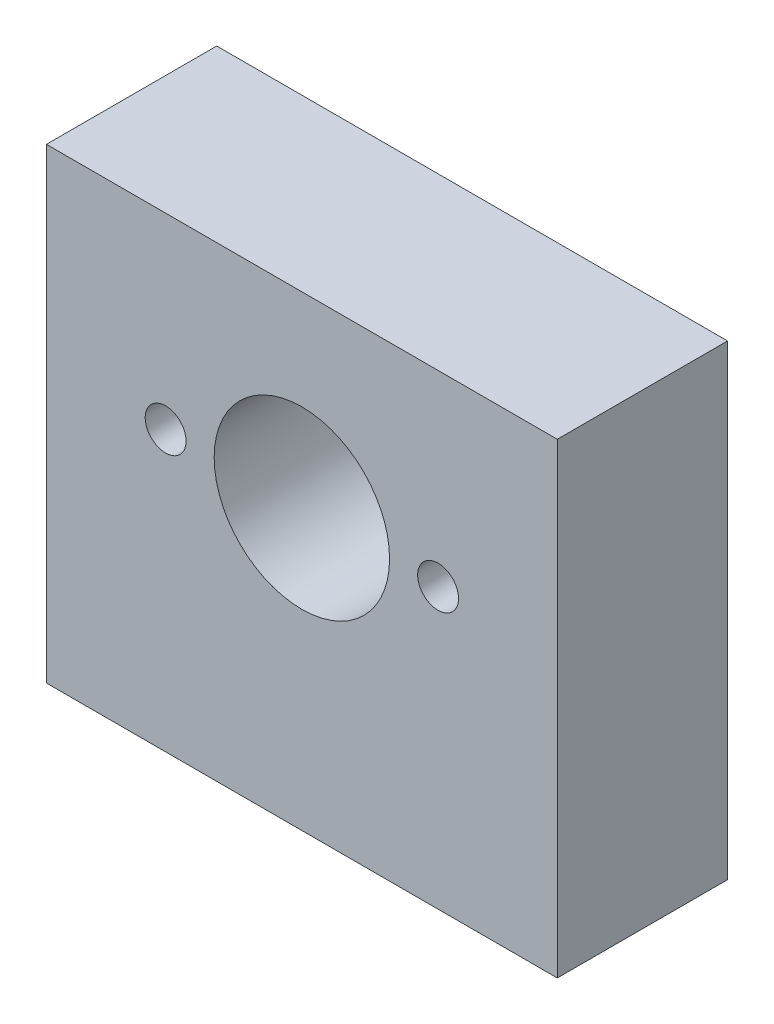
ISO-10303-21;
HEADER;
FILE_DESCRIPTION(('STEP AP214'),'2;1');
FILE_NAME('part.step','',(''),(''),'','','');
FILE_SCHEMA(('AUTOMOTIVE_DESIGN { 1 0 10303 214 1 1 1 1 }'));
ENDSEC;
DATA;
#1=APPLICATION_CONTEXT('core data for automotive mechanical design processes');
#2=APPLICATION_PROTOCOL_DEFINITION('international standard','automotive_design',2000,#1);
#3=PRODUCT_CONTEXT('',#1,'mechanical');
#4=PRODUCT('Part','Part','',(#3));
#5=PRODUCT_RELATED_PRODUCT_CATEGORY('part','',(#4));
#6=PRODUCT_DEFINITION_FORMATION('','',#4);
#7=PRODUCT_DEFINITION_CONTEXT('part definition',#1,'design');
#8=PRODUCT_DEFINITION('design','',#6,#7);
#9=PRODUCT_DEFINITION_SHAPE('','',#8);
#10=(LENGTH_UNIT() NAMED_UNIT(*) SI_UNIT(.MILLI.,.METRE.));
#11=(NAMED_UNIT(*) PLANE_ANGLE_UNIT() SI_UNIT($,.RADIAN.));
#12=(NAMED_UNIT(*) SI_UNIT($,.STERADIAN.) SOLID_ANGLE_UNIT());
#13=UNCERTAINTY_MEASURE_WITH_UNIT(LENGTH_MEASURE(1.E-05),#10,'distance_accuracy_value','');
#14=(GEOMETRIC_REPRESENTATION_CONTEXT(3) GLOBAL_UNCERTAINTY_ASSIGNED_CONTEXT((#13)) GLOBAL_UNIT_ASSIGNED_CONTEXT((#10,
#11,#12)) REPRESENTATION_CONTEXT('',''));
#15=CARTESIAN_POINT('',(0.,0.,0.));
#16=DIRECTION('',(0.,0.,1.));
#17=DIRECTION('',(1.,0.,0.));
#18=AXIS2_PLACEMENT_3D('',#15,#16,#17);
#19=CARTESIAN_POINT('',(0.,0.,10.));
#20=DIRECTION('',(0.,0.,1.));
#21=DIRECTION('',(1.,0.,0.));
#22=AXIS2_PLACEMENT_3D('',#19,#20,#21);
#23=PLANE('',#22);
#24=CARTESIAN_POINT('',(-8.,0.,10.));
#25=DIRECTION('',(0.,0.,1.));
#26=DIRECTION('',(1.,0.,0.));
#27=AXIS2_PLACEMENT_3D('',#24,#25,#26);
#28=CIRCLE('',#27,1.2);
#29=CARTESIAN_POINT('',(-6.8,0.,10.));
#30=VERTEX_POINT('',#29);
#31=EDGE_CURVE('E162',#30,#30,#28,.T.);
#32=ORIENTED_EDGE('',*,*,#31,.F.);
#33=EDGE_LOOP('',(#32));
#34=FACE_BOUND('',#33,.T.);
#35=CARTESIAN_POINT('',(8.,0.,10.));
#36=DIRECTION('',(0.,0.,1.));
#37=DIRECTION('',(-1.,0.,0.));
#38=AXIS2_PLACEMENT_3D('',#35,#36,#37);
#39=CIRCLE('',#38,1.2);
#40=CARTESIAN_POINT('',(6.8,0.,10.));
#41=VERTEX_POINT('',#40);
#42=EDGE_CURVE('E154',#41,#41,#39,.T.);
#43=ORIENTED_EDGE('',*,*,#42,.F.);
#44=EDGE_LOOP('',(#43));
#45=FACE_BOUND('',#44,.T.);
#46=DIRECTION('',(0.,-1.,0.));
#47=VECTOR('',#46,1.);
#48=CARTESIAN_POINT('',(-15.,-16.4,10.));
#49=LINE('',#48,#47);
#50=CARTESIAN_POINT('',(-15.,11.,10.));
#51=VERTEX_POINT('',#50);
#52=CARTESIAN_POINT('',(-15.,-16.4,10.));
#53=VERTEX_POINT('',#52);
#54=EDGE_CURVE('E92',#51,#53,#49,.T.);
#55=ORIENTED_EDGE('',*,*,#54,.T.);
#56=DIRECTION('',(1.,0.,0.));
#57=VECTOR('',#56,1.);
#58=CARTESIAN_POINT('',(15.,-16.4,10.));
#59=LINE('',#58,#57);
#60=CARTESIAN_POINT('',(15.,-16.4,10.));
#61=VERTEX_POINT('',#60);
#62=EDGE_CURVE('E87',#53,#61,#59,.T.);
#63=ORIENTED_EDGE('',*,*,#62,.T.);
#64=DIRECTION('',(0.,1.,0.));
#65=VECTOR('',#64,1.);
#66=CARTESIAN_POINT('',(15.,-16.4,10.));
#67=LINE('',#66,#65);
#68=CARTESIAN_POINT('',(15.,11.,10.));
#69=VERTEX_POINT('',#68);
#70=EDGE_CURVE('E90',#61,#69,#67,.T.);
#71=ORIENTED_EDGE('',*,*,#70,.T.);
#72=DIRECTION('',(-1.,0.,0.));
#73=VECTOR('',#72,1.);
#74=CARTESIAN_POINT('',(15.,11.,10.));
#75=LINE('',#74,#73);
#76=EDGE_CURVE('E57',#69,#51,#75,.T.);
#77=ORIENTED_EDGE('',*,*,#76,.T.);
#78=EDGE_LOOP('',(#55,#63,#71,#77));
#79=FACE_BOUND('',#78,.T.);
#80=CARTESIAN_POINT('',(0.,0.,10.));
#81=DIRECTION('',(0.,0.,1.));
#82=DIRECTION('',(1.,0.,0.));
#83=AXIS2_PLACEMENT_3D('',#80,#81,#82);
#84=CIRCLE('',#83,5.15);
#85=CARTESIAN_POINT('',(5.15,0.,10.));
#86=VERTEX_POINT('',#85);
#87=EDGE_CURVE('E112',#86,#86,#84,.T.);
#88=ORIENTED_EDGE('',*,*,#87,.F.);
#89=EDGE_LOOP('',(#88));
#90=FACE_BOUND('',#89,.T.);
#91=ADVANCED_FACE('F39',(#34,#45,#79,#90),#23,.T.);
#92=CARTESIAN_POINT('',(0.,0.,0.));
#93=DIRECTION('',(0.,0.,1.));
#94=DIRECTION('',(1.,0.,0.));
#95=AXIS2_PLACEMENT_3D('',#92,#93,#94);
#96=PLANE('',#95);
#97=CARTESIAN_POINT('',(-8.,0.,0.));
#98=DIRECTION('',(0.,0.,1.));
#99=DIRECTION('',(1.,0.,0.));
#100=AXIS2_PLACEMENT_3D('',#97,#98,#99);
#101=CIRCLE('',#100,1.2);
#102=CARTESIAN_POINT('',(-6.8,0.,0.));
#103=VERTEX_POINT('',#102);
#104=EDGE_CURVE('E143',#103,#103,#101,.T.);
#105=ORIENTED_EDGE('',*,*,#104,.T.);
#106=EDGE_LOOP('',(#105));
#107=FACE_BOUND('',#106,.T.);
#108=CARTESIAN_POINT('',(8.,0.,0.));
#109=DIRECTION('',(0.,0.,1.));
#110=DIRECTION('',(-1.,0.,0.));
#111=AXIS2_PLACEMENT_3D('',#108,#109,#110);
#112=CIRCLE('',#111,1.2);
#113=CARTESIAN_POINT('',(6.8,0.,0.));
#114=VERTEX_POINT('',#113);
#115=EDGE_CURVE('E158',#114,#114,#112,.T.);
#116=ORIENTED_EDGE('',*,*,#115,.T.);
#117=EDGE_LOOP('',(#116));
#118=FACE_BOUND('',#117,.T.);
#119=DIRECTION('',(0.,-1.,0.));
#120=VECTOR('',#119,1.);
#121=CARTESIAN_POINT('',(-15.,-16.4,0.));
#122=LINE('',#121,#120);
#123=CARTESIAN_POINT('',(-15.,11.,0.));
#124=VERTEX_POINT('',#123);
#125=CARTESIAN_POINT('',(-15.,-16.4,0.));
#126=VERTEX_POINT('',#125);
#127=EDGE_CURVE('E108',#124,#126,#122,.T.);
#128=ORIENTED_EDGE('',*,*,#127,.F.);
#129=DIRECTION('',(-1.,0.,0.));
#130=VECTOR('',#129,1.);
#131=CARTESIAN_POINT('',(15.,11.,0.));
#132=LINE('',#131,#130);
#133=CARTESIAN_POINT('',(15.,11.,0.));
#134=VERTEX_POINT('',#133);
#135=EDGE_CURVE('E80',#134,#124,#132,.T.);
#136=ORIENTED_EDGE('',*,*,#135,.F.);
#137=DIRECTION('',(0.,1.,0.));
#138=VECTOR('',#137,1.);
#139=CARTESIAN_POINT('',(15.,-16.4,0.));
#140=LINE('',#139,#138);
#141=CARTESIAN_POINT('',(15.,-16.4,0.));
#142=VERTEX_POINT('',#141);
#143=EDGE_CURVE('E74',#142,#134,#140,.T.);
#144=ORIENTED_EDGE('',*,*,#143,.F.);
#145=DIRECTION('',(1.,0.,0.));
#146=VECTOR('',#145,1.);
#147=CARTESIAN_POINT('',(15.,-16.4,0.));
#148=LINE('',#147,#146);
#149=EDGE_CURVE('E97',#126,#142,#148,.T.);
#150=ORIENTED_EDGE('',*,*,#149,.F.);
#151=EDGE_LOOP('',(#128,#136,#144,#150));
#152=FACE_BOUND('',#151,.T.);
#153=CARTESIAN_POINT('',(0.,0.,0.));
#154=DIRECTION('',(0.,0.,1.));
#155=DIRECTION('',(1.,0.,0.));
#156=AXIS2_PLACEMENT_3D('',#153,#154,#155);
#157=CIRCLE('',#156,5.15);
#158=CARTESIAN_POINT('',(5.15,0.,0.));
#159=VERTEX_POINT('',#158);
#160=EDGE_CURVE('E130',#159,#159,#157,.T.);
#161=ORIENTED_EDGE('',*,*,#160,.T.);
#162=EDGE_LOOP('',(#161));
#163=FACE_BOUND('',#162,.T.);
#164=ADVANCED_FACE('F125',(#107,#118,#152,#163),#96,.F.);
#165=CARTESIAN_POINT('',(-15.,-16.4,10.));
#166=DIRECTION('',(1.,0.,0.));
#167=DIRECTION('',(0.,1.,0.));
#168=AXIS2_PLACEMENT_3D('',#165,#166,#167);
#169=PLANE('',#168);
#170=ORIENTED_EDGE('',*,*,#127,.T.);
#171=DIRECTION('',(0.,0.,-1.));
#172=VECTOR('',#171,1.);
#173=CARTESIAN_POINT('',(-15.,-16.4,10.));
#174=LINE('',#173,#172);
#175=EDGE_CURVE('E11',#53,#126,#174,.T.);
#176=ORIENTED_EDGE('',*,*,#175,.F.);
#177=ORIENTED_EDGE('',*,*,#54,.F.);
#178=DIRECTION('',(0.,0.,-1.));
#179=VECTOR('',#178,1.);
#180=CARTESIAN_POINT('',(-15.,11.,10.));
#181=LINE('',#180,#179);
#182=EDGE_CURVE('E104',#51,#124,#181,.T.);
#183=ORIENTED_EDGE('',*,*,#182,.T.);
#184=EDGE_LOOP('',(#170,#176,#177,#183));
#185=FACE_BOUND('',#184,.T.);
#186=ADVANCED_FACE('F41',(#185),#169,.F.);
#187=CARTESIAN_POINT('',(15.,-16.4,10.));
#188=DIRECTION('',(0.,1.,0.));
#189=DIRECTION('',(0.,0.,1.));
#190=AXIS2_PLACEMENT_3D('',#187,#188,#189);
#191=PLANE('',#190);
#192=CARTESIAN_POINT('',(-11.,-16.4,5.));
#193=DIRECTION('',(0.,-1.,0.));
#194=DIRECTION('',(0.,0.,-1.));
#195=AXIS2_PLACEMENT_3D('',#192,#193,#194);
#196=CIRCLE('',#195,2.);
#197=CARTESIAN_POINT('',(-11.,-16.4,3.));
#198=VERTEX_POINT('',#197);
#199=EDGE_CURVE('E147',#198,#198,#196,.T.);
#200=ORIENTED_EDGE('',*,*,#199,.F.);
#201=EDGE_LOOP('',(#200));
#202=FACE_BOUND('',#201,.T.);
#203=CARTESIAN_POINT('',(11.,-16.4,5.));
#204=DIRECTION('',(0.,-1.,0.));
#205=DIRECTION('',(0.,0.,1.));
#206=AXIS2_PLACEMENT_3D('',#203,#204,#205);
#207=CIRCLE('',#206,2.);
#208=CARTESIAN_POINT('',(11.,-16.4,7.));
#209=VERTEX_POINT('',#208);
#210=EDGE_CURVE('E138',#209,#209,#207,.T.);
#211=ORIENTED_EDGE('',*,*,#210,.F.);
#212=EDGE_LOOP('',(#211));
#213=FACE_BOUND('',#212,.T.);
#214=ORIENTED_EDGE('',*,*,#149,.T.);
#215=DIRECTION('',(0.,0.,-1.));
#216=VECTOR('',#215,1.);
#217=CARTESIAN_POINT('',(15.,-16.4,10.));
#218=LINE('',#217,#216);
#219=EDGE_CURVE('E49',#61,#142,#218,.T.);
#220=ORIENTED_EDGE('',*,*,#219,.F.);
#221=ORIENTED_EDGE('',*,*,#62,.F.);
#222=ORIENTED_EDGE('',*,*,#175,.T.);
#223=EDGE_LOOP('',(#214,#220,#221,#222));
#224=FACE_BOUND('',#223,.T.);
#225=ADVANCED_FACE('F96',(#202,#213,#224),#191,.F.);
#226=CARTESIAN_POINT('',(15.,-16.4,10.));
#227=DIRECTION('',(-1.,0.,0.));
#228=DIRECTION('',(0.,-1.,0.));
#229=AXIS2_PLACEMENT_3D('',#226,#227,#228);
#230=PLANE('',#229);
#231=ORIENTED_EDGE('',*,*,#143,.T.);
#232=DIRECTION('',(0.,0.,-1.));
#233=VECTOR('',#232,1.);
#234=CARTESIAN_POINT('',(15.,11.,10.));
#235=LINE('',#234,#233);
#236=EDGE_CURVE('E99',#69,#134,#235,.T.);
#237=ORIENTED_EDGE('',*,*,#236,.F.);
#238=ORIENTED_EDGE('',*,*,#70,.F.);
#239=ORIENTED_EDGE('',*,*,#219,.T.);
#240=EDGE_LOOP('',(#231,#237,#238,#239));
#241=FACE_BOUND('',#240,.T.);
#242=ADVANCED_FACE('F100',(#241),#230,.F.);
#243=CARTESIAN_POINT('',(15.,11.,10.));
#244=DIRECTION('',(0.,-1.,0.));
#245=DIRECTION('',(0.,0.,-1.));
#246=AXIS2_PLACEMENT_3D('',#243,#244,#245);
#247=PLANE('',#246);
#248=ORIENTED_EDGE('',*,*,#135,.T.);
#249=ORIENTED_EDGE('',*,*,#182,.F.);
#250=ORIENTED_EDGE('',*,*,#76,.F.);
#251=ORIENTED_EDGE('',*,*,#236,.T.);
#252=EDGE_LOOP('',(#248,#249,#250,#251));
#253=FACE_BOUND('',#252,.T.);
#254=ADVANCED_FACE('F122',(#253),#247,.F.);
#255=CARTESIAN_POINT('',(0.,0.,10.));
#256=DIRECTION('',(0.,0.,-1.));
#257=DIRECTION('',(-1.,0.,0.));
#258=AXIS2_PLACEMENT_3D('',#255,#256,#257);
#259=CYLINDRICAL_SURFACE('',#258,5.15);
#260=ORIENTED_EDGE('',*,*,#87,.T.);
#261=EDGE_LOOP('',(#260));
#262=FACE_BOUND('',#261,.T.);
#263=ORIENTED_EDGE('',*,*,#160,.F.);
#264=EDGE_LOOP('',(#263));
#265=FACE_BOUND('',#264,.T.);
#266=ADVANCED_FACE('F206',(#262,#265),#259,.F.);
#267=CARTESIAN_POINT('',(11.,-6.4,5.));
#268=DIRECTION('',(0.,-1.,0.));
#269=DIRECTION('',(0.,0.,-1.));
#270=AXIS2_PLACEMENT_3D('',#267,#268,#269);
#271=CYLINDRICAL_SURFACE('',#270,2.);
#272=CARTESIAN_POINT('',(11.,-6.4,5.));
#273=DIRECTION('',(0.,-1.,0.));
#274=DIRECTION('',(0.,0.,1.));
#275=AXIS2_PLACEMENT_3D('',#272,#273,#274);
#276=CIRCLE('',#275,2.);
#277=CARTESIAN_POINT('',(11.,-6.4,7.));
#278=VERTEX_POINT('',#277);
#279=EDGE_CURVE('E142',#278,#278,#276,.T.);
#280=ORIENTED_EDGE('',*,*,#279,.F.);
#281=EDGE_LOOP('',(#280));
#282=FACE_BOUND('',#281,.T.);
#283=ORIENTED_EDGE('',*,*,#210,.T.);
#284=EDGE_LOOP('',(#283));
#285=FACE_BOUND('',#284,.T.);
#286=ADVANCED_FACE('F202',(#282,#285),#271,.F.);
#287=CARTESIAN_POINT('',(11.,-6.4,5.));
#288=DIRECTION('',(0.,1.,0.));
#289=DIRECTION('',(0.,0.,1.));
#290=AXIS2_PLACEMENT_3D('',#287,#288,#289);
#291=PLANE('',#290);
#292=ORIENTED_EDGE('',*,*,#279,.T.);
#293=EDGE_LOOP('',(#292));
#294=FACE_BOUND('',#293,.T.);
#295=ADVANCED_FACE('F198',(#294),#291,.F.);
#296=CARTESIAN_POINT('',(-11.,-6.4,5.));
#297=DIRECTION('',(0.,-1.,0.));
#298=DIRECTION('',(0.,0.,-1.));
#299=AXIS2_PLACEMENT_3D('',#296,#297,#298);
#300=CYLINDRICAL_SURFACE('',#299,2.);
#301=CARTESIAN_POINT('',(-11.,-6.4,5.));
#302=DIRECTION('',(0.,-1.,0.));
#303=DIRECTION('',(0.,0.,-1.));
#304=AXIS2_PLACEMENT_3D('',#301,#302,#303);
#305=CIRCLE('',#304,2.);
#306=CARTESIAN_POINT('',(-11.,-6.4,3.));
#307=VERTEX_POINT('',#306);
#308=EDGE_CURVE('E134',#307,#307,#305,.T.);
#309=ORIENTED_EDGE('',*,*,#308,.F.);
#310=EDGE_LOOP('',(#309));
#311=FACE_BOUND('',#310,.T.);
#312=ORIENTED_EDGE('',*,*,#199,.T.);
#313=EDGE_LOOP('',(#312));
#314=FACE_BOUND('',#313,.T.);
#315=ADVANCED_FACE('F191',(#311,#314),#300,.F.);
#316=CARTESIAN_POINT('',(-11.,-6.4,5.));
#317=DIRECTION('',(0.,-1.,0.));
#318=DIRECTION('',(0.,0.,-1.));
#319=AXIS2_PLACEMENT_3D('',#316,#317,#318);
#320=PLANE('',#319);
#321=ORIENTED_EDGE('',*,*,#308,.T.);
#322=EDGE_LOOP('',(#321));
#323=FACE_BOUND('',#322,.T.);
#324=ADVANCED_FACE('F185',(#323),#320,.T.);
#325=CARTESIAN_POINT('',(8.,0.,0.));
#326=DIRECTION('',(0.,0.,1.));
#327=DIRECTION('',(1.,0.,0.));
#328=AXIS2_PLACEMENT_3D('',#325,#326,#327);
#329=CYLINDRICAL_SURFACE('',#328,1.2);
#330=ORIENTED_EDGE('',*,*,#115,.F.);
#331=EDGE_LOOP('',(#330));
#332=FACE_BOUND('',#331,.T.);
#333=ORIENTED_EDGE('',*,*,#42,.T.);
#334=EDGE_LOOP('',(#333));
#335=FACE_BOUND('',#334,.T.);
#336=ADVANCED_FACE('F175',(#332,#335),#329,.F.);
#337=CARTESIAN_POINT('',(-8.,0.,0.));
#338=DIRECTION('',(0.,0.,1.));
#339=DIRECTION('',(1.,0.,0.));
#340=AXIS2_PLACEMENT_3D('',#337,#338,#339);
#341=CYLINDRICAL_SURFACE('',#340,1.2);
#342=ORIENTED_EDGE('',*,*,#104,.F.);
#343=EDGE_LOOP('',(#342));
#344=FACE_BOUND('',#343,.T.);
#345=ORIENTED_EDGE('',*,*,#31,.T.);
#346=EDGE_LOOP('',(#345));
#347=FACE_BOUND('',#346,.T.);
#348=ADVANCED_FACE('F172',(#344,#347),#341,.F.);
#349=CLOSED_SHELL('',(#91,#164,#186,#225,#242,#254,#266,#286,#295,#315,#324,#336,#348));
#350=MANIFOLD_SOLID_BREP('B2',#349);
#351=ADVANCED_BREP_SHAPE_REPRESENTATION('',(#18,#350),#14);
#352=SHAPE_DEFINITION_REPRESENTATION(#9,#351);
ENDSEC;
END-ISO-10303-21;
